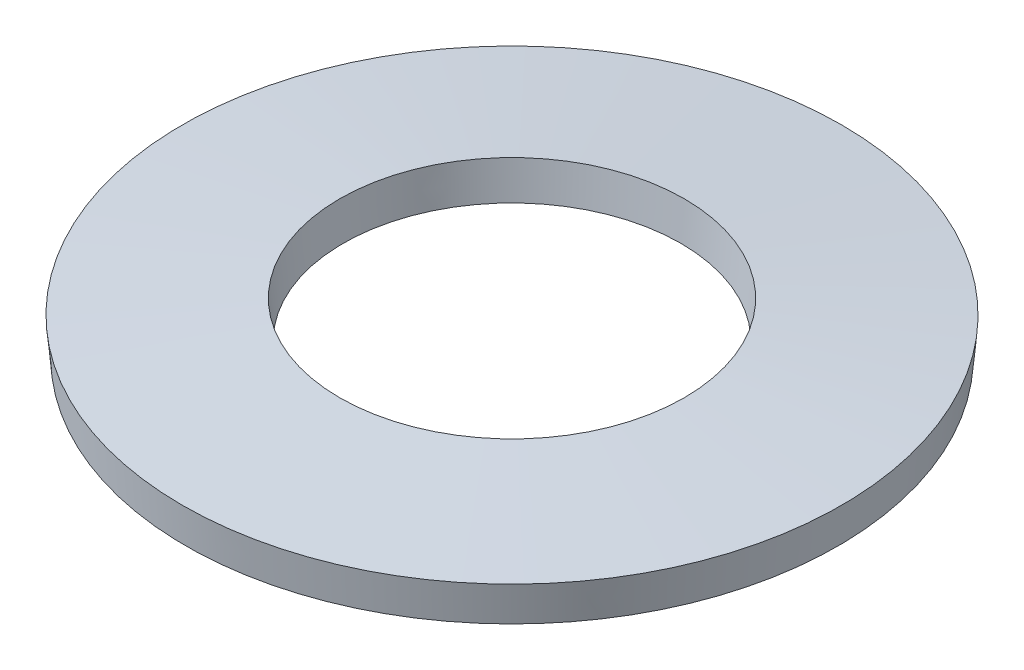
ISO-10303-21;
HEADER;
FILE_DESCRIPTION(('STEP AP214'),'2;1');
FILE_NAME('part.step','',(''),(''),'','','');
FILE_SCHEMA(('AUTOMOTIVE_DESIGN { 1 0 10303 214 1 1 1 1 }'));
ENDSEC;
DATA;
#1=APPLICATION_CONTEXT('core data for automotive mechanical design processes');
#2=APPLICATION_PROTOCOL_DEFINITION('international standard','automotive_design',2000,#1);
#3=PRODUCT_CONTEXT('',#1,'mechanical');
#4=PRODUCT('Part','Part','',(#3));
#5=PRODUCT_RELATED_PRODUCT_CATEGORY('part','',(#4));
#6=PRODUCT_DEFINITION_FORMATION('','',#4);
#7=PRODUCT_DEFINITION_CONTEXT('part definition',#1,'design');
#8=PRODUCT_DEFINITION('design','',#6,#7);
#9=PRODUCT_DEFINITION_SHAPE('','',#8);
#10=(LENGTH_UNIT() NAMED_UNIT(*) SI_UNIT(.MILLI.,.METRE.));
#11=(NAMED_UNIT(*) PLANE_ANGLE_UNIT() SI_UNIT($,.RADIAN.));
#12=(NAMED_UNIT(*) SI_UNIT($,.STERADIAN.) SOLID_ANGLE_UNIT());
#13=UNCERTAINTY_MEASURE_WITH_UNIT(LENGTH_MEASURE(1.E-05),#10,'distance_accuracy_value','');
#14=(GEOMETRIC_REPRESENTATION_CONTEXT(3) GLOBAL_UNCERTAINTY_ASSIGNED_CONTEXT((#13)) GLOBAL_UNIT_ASSIGNED_CONTEXT((#10,
#11,#12)) REPRESENTATION_CONTEXT('',''));
#15=CARTESIAN_POINT('',(0.,0.,0.));
#16=DIRECTION('',(0.,0.,1.));
#17=DIRECTION('',(1.,0.,0.));
#18=AXIS2_PLACEMENT_3D('',#15,#16,#17);
#19=CARTESIAN_POINT('',(0.,0.,0.));
#20=DIRECTION('',(0.,1.,0.));
#21=DIRECTION('',(0.,0.,1.));
#22=AXIS2_PLACEMENT_3D('',#19,#20,#21);
#23=CONICAL_SURFACE('',#22,7.91692296903025,0.0924394057465409);
#24=CARTESIAN_POINT('',(0.,0.896157467706012,0.));
#25=DIRECTION('',(0.,-1.,0.));
#26=DIRECTION('',(0.,0.,-1.));
#27=AXIS2_PLACEMENT_3D('',#24,#25,#26);
#28=CIRCLE('',#27,8.);
#29=CARTESIAN_POINT('',(0.,0.896157467706012,-8.));
#30=VERTEX_POINT('',#29);
#31=EDGE_CURVE('E43',#30,#30,#28,.T.);
#32=ORIENTED_EDGE('',*,*,#31,.T.);
#33=EDGE_LOOP('',(#32));
#34=FACE_BOUND('',#33,.T.);
#35=CARTESIAN_POINT('',(0.,0.,0.));
#36=DIRECTION('',(0.,-1.,0.));
#37=DIRECTION('',(0.,0.,-1.));
#38=AXIS2_PLACEMENT_3D('',#35,#36,#37);
#39=CIRCLE('',#38,7.91692296903025);
#40=CARTESIAN_POINT('',(0.,0.,-7.91692296903025));
#41=VERTEX_POINT('',#40);
#42=EDGE_CURVE('E10',#41,#41,#39,.T.);
#43=ORIENTED_EDGE('',*,*,#42,.F.);
#44=EDGE_LOOP('',(#43));
#45=FACE_BOUND('',#44,.T.);
#46=ADVANCED_FACE('F29',(#34,#45),#23,.T.);
#47=CARTESIAN_POINT('',(0.,0.353842532293988,0.));
#48=DIRECTION('',(0.,-1.,0.));
#49=DIRECTION('',(0.,0.,-1.));
#50=AXIS2_PLACEMENT_3D('',#47,#48,#49);
#51=CONICAL_SURFACE('',#50,4.1,1.47835692104836);
#52=ORIENTED_EDGE('',*,*,#42,.T.);
#53=EDGE_LOOP('',(#52));
#54=FACE_BOUND('',#53,.T.);
#55=CARTESIAN_POINT('',(0.,0.353842532293988,0.));
#56=DIRECTION('',(0.,-1.,0.));
#57=DIRECTION('',(0.,0.,-1.));
#58=AXIS2_PLACEMENT_3D('',#55,#56,#57);
#59=CIRCLE('',#58,4.1);
#60=CARTESIAN_POINT('',(0.,0.353842532293988,-4.1));
#61=VERTEX_POINT('',#60);
#62=EDGE_CURVE('E35',#61,#61,#59,.T.);
#63=ORIENTED_EDGE('',*,*,#62,.F.);
#64=EDGE_LOOP('',(#63));
#65=FACE_BOUND('',#64,.T.);
#66=ADVANCED_FACE('F59',(#54,#65),#51,.F.);
#67=CARTESIAN_POINT('',(0.,1.25,0.));
#68=DIRECTION('',(0.,1.,0.));
#69=DIRECTION('',(0.,0.,1.));
#70=AXIS2_PLACEMENT_3D('',#67,#68,#69);
#71=CONICAL_SURFACE('',#70,4.18307703096974,0.0924394057465409);
#72=ORIENTED_EDGE('',*,*,#62,.T.);
#73=EDGE_LOOP('',(#72));
#74=FACE_BOUND('',#73,.T.);
#75=CARTESIAN_POINT('',(0.,1.25,0.));
#76=DIRECTION('',(0.,-1.,0.));
#77=DIRECTION('',(0.,0.,-1.));
#78=AXIS2_PLACEMENT_3D('',#75,#76,#77);
#79=CIRCLE('',#78,4.18307703096974);
#80=CARTESIAN_POINT('',(0.,1.25,-4.18307703096974));
#81=VERTEX_POINT('',#80);
#82=EDGE_CURVE('E39',#81,#81,#79,.T.);
#83=ORIENTED_EDGE('',*,*,#82,.F.);
#84=EDGE_LOOP('',(#83));
#85=FACE_BOUND('',#84,.T.);
#86=ADVANCED_FACE('F53',(#74,#85),#71,.F.);
#87=CARTESIAN_POINT('',(0.,0.896157467706012,0.));
#88=DIRECTION('',(0.,-1.,0.));
#89=DIRECTION('',(0.,0.,-1.));
#90=AXIS2_PLACEMENT_3D('',#87,#88,#89);
#91=CONICAL_SURFACE('',#90,8.,1.47835692104836);
#92=ORIENTED_EDGE('',*,*,#82,.T.);
#93=EDGE_LOOP('',(#92));
#94=FACE_BOUND('',#93,.T.);
#95=ORIENTED_EDGE('',*,*,#31,.F.);
#96=EDGE_LOOP('',(#95));
#97=FACE_BOUND('',#96,.T.);
#98=ADVANCED_FACE('F51',(#94,#97),#91,.T.);
#99=CLOSED_SHELL('',(#46,#66,#86,#98));
#100=MANIFOLD_SOLID_BREP('B2',#99);
#101=ADVANCED_BREP_SHAPE_REPRESENTATION('',(#18,#100),#14);
#102=SHAPE_DEFINITION_REPRESENTATION(#9,#101);
ENDSEC;
END-ISO-10303-21;
